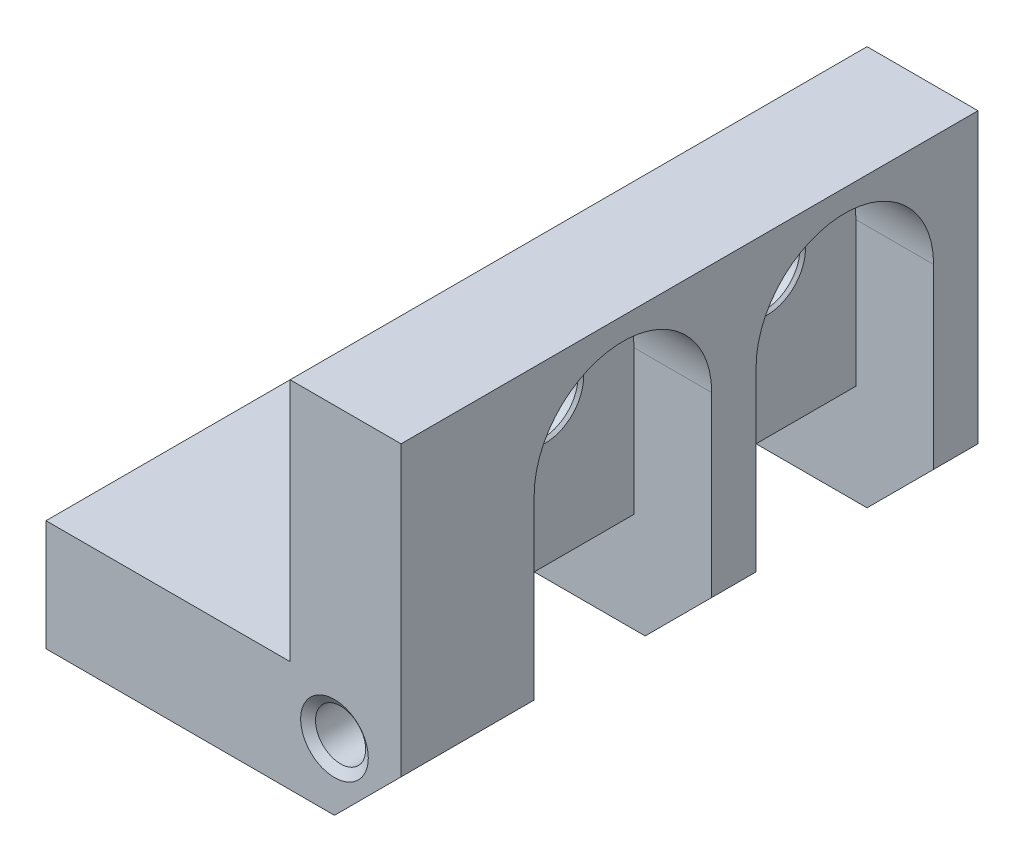
ISO-10303-21;
HEADER;
FILE_DESCRIPTION(('STEP AP214'),'2;1');
FILE_NAME('part.step','',(''),(''),'','','');
FILE_SCHEMA(('AUTOMOTIVE_DESIGN { 1 0 10303 214 1 1 1 1 }'));
ENDSEC;
DATA;
#1=APPLICATION_CONTEXT('core data for automotive mechanical design processes');
#2=APPLICATION_PROTOCOL_DEFINITION('international standard','automotive_design',2000,#1);
#3=PRODUCT_CONTEXT('',#1,'mechanical');
#4=PRODUCT('Part','Part','',(#3));
#5=PRODUCT_RELATED_PRODUCT_CATEGORY('part','',(#4));
#6=PRODUCT_DEFINITION_FORMATION('','',#4);
#7=PRODUCT_DEFINITION_CONTEXT('part definition',#1,'design');
#8=PRODUCT_DEFINITION('design','',#6,#7);
#9=PRODUCT_DEFINITION_SHAPE('','',#8);
#10=(LENGTH_UNIT() NAMED_UNIT(*) SI_UNIT(.MILLI.,.METRE.));
#11=(NAMED_UNIT(*) PLANE_ANGLE_UNIT() SI_UNIT($,.RADIAN.));
#12=(NAMED_UNIT(*) SI_UNIT($,.STERADIAN.) SOLID_ANGLE_UNIT());
#13=UNCERTAINTY_MEASURE_WITH_UNIT(LENGTH_MEASURE(1.E-05),#10,'distance_accuracy_value','');
#14=(GEOMETRIC_REPRESENTATION_CONTEXT(3) GLOBAL_UNCERTAINTY_ASSIGNED_CONTEXT((#13)) GLOBAL_UNIT_ASSIGNED_CONTEXT((#10,
#11,#12)) REPRESENTATION_CONTEXT('',''));
#15=CARTESIAN_POINT('',(0.,0.,0.));
#16=DIRECTION('',(0.,0.,1.));
#17=DIRECTION('',(1.,0.,0.));
#18=AXIS2_PLACEMENT_3D('',#15,#16,#17);
#19=CARTESIAN_POINT('',(4.5,0.,26.));
#20=DIRECTION('',(1.,0.,0.));
#21=DIRECTION('',(0.,1.,0.));
#22=AXIS2_PLACEMENT_3D('',#19,#20,#21);
#23=PLANE('',#22);
#24=CARTESIAN_POINT('',(4.5,3.,6.00000000000002));
#25=DIRECTION('',(1.,0.,0.));
#26=DIRECTION('',(0.,0.,-1.));
#27=AXIS2_PLACEMENT_3D('',#24,#25,#26);
#28=CIRCLE('',#27,1.725);
#29=CARTESIAN_POINT('',(4.5,3.,4.27500000000002));
#30=VERTEX_POINT('',#29);
#31=EDGE_CURVE('E450',#30,#30,#28,.T.);
#32=ORIENTED_EDGE('',*,*,#31,.F.);
#33=EDGE_LOOP('',(#32));
#34=FACE_BOUND('',#33,.T.);
#35=DIRECTION('',(0.,-1.,0.));
#36=VECTOR('',#35,1.);
#37=CARTESIAN_POINT('',(4.5,0.,10.));
#38=LINE('',#37,#36);
#39=CARTESIAN_POINT('',(4.5,3.,10.));
#40=VERTEX_POINT('',#39);
#41=CARTESIAN_POINT('',(4.5,-3.5,10.));
#42=VERTEX_POINT('',#41);
#43=EDGE_CURVE('E247',#40,#42,#38,.T.);
#44=ORIENTED_EDGE('',*,*,#43,.T.);
#45=DIRECTION('',(0.,0.,-1.));
#46=VECTOR('',#45,1.);
#47=CARTESIAN_POINT('',(4.5,-3.5,26.));
#48=LINE('',#47,#46);
#49=CARTESIAN_POINT('',(4.5,-3.5,2.00000000000002));
#50=VERTEX_POINT('',#49);
#51=EDGE_CURVE('E332',#42,#50,#48,.T.);
#52=ORIENTED_EDGE('',*,*,#51,.T.);
#53=DIRECTION('',(0.,-1.,0.));
#54=VECTOR('',#53,1.);
#55=CARTESIAN_POINT('',(4.5,0.,2.00000000000002));
#56=LINE('',#55,#54);
#57=CARTESIAN_POINT('',(4.5,3.,2.00000000000002));
#58=VERTEX_POINT('',#57);
#59=EDGE_CURVE('E243',#58,#50,#56,.T.);
#60=ORIENTED_EDGE('',*,*,#59,.F.);
#61=CARTESIAN_POINT('',(4.5,3.,6.00000000000002));
#62=DIRECTION('',(1.,0.,0.));
#63=DIRECTION('',(0.,1.,0.));
#64=AXIS2_PLACEMENT_3D('',#61,#62,#63);
#65=CIRCLE('',#64,4.);
#66=EDGE_CURVE('E246',#58,#40,#65,.T.);
#67=ORIENTED_EDGE('',*,*,#66,.T.);
#68=EDGE_LOOP('',(#44,#52,#60,#67));
#69=FACE_BOUND('',#68,.T.);
#70=ADVANCED_FACE('F33',(#34,#69),#23,.T.);
#71=CARTESIAN_POINT('',(4.5,0.,26.));
#72=DIRECTION('',(1.,0.,0.));
#73=DIRECTION('',(0.,1.,0.));
#74=AXIS2_PLACEMENT_3D('',#71,#72,#73);
#75=PLANE('',#74);
#76=CARTESIAN_POINT('',(4.5,3.,16.));
#77=DIRECTION('',(1.,0.,0.));
#78=DIRECTION('',(0.,0.,-1.));
#79=AXIS2_PLACEMENT_3D('',#76,#77,#78);
#80=CIRCLE('',#79,1.725);
#81=CARTESIAN_POINT('',(4.5,3.,14.275));
#82=VERTEX_POINT('',#81);
#83=EDGE_CURVE('E438',#82,#82,#80,.T.);
#84=ORIENTED_EDGE('',*,*,#83,.F.);
#85=EDGE_LOOP('',(#84));
#86=FACE_BOUND('',#85,.T.);
#87=DIRECTION('',(0.,-1.,0.));
#88=VECTOR('',#87,1.);
#89=CARTESIAN_POINT('',(4.5,0.,20.));
#90=LINE('',#89,#88);
#91=CARTESIAN_POINT('',(4.5,3.,20.));
#92=VERTEX_POINT('',#91);
#93=CARTESIAN_POINT('',(4.5,-3.5,20.));
#94=VERTEX_POINT('',#93);
#95=EDGE_CURVE('E265',#92,#94,#90,.T.);
#96=ORIENTED_EDGE('',*,*,#95,.T.);
#97=DIRECTION('',(0.,0.,-1.));
#98=VECTOR('',#97,1.);
#99=CARTESIAN_POINT('',(4.5,-3.5,26.));
#100=LINE('',#99,#98);
#101=CARTESIAN_POINT('',(4.5,-3.5,12.));
#102=VERTEX_POINT('',#101);
#103=EDGE_CURVE('E337',#94,#102,#100,.T.);
#104=ORIENTED_EDGE('',*,*,#103,.T.);
#105=DIRECTION('',(0.,-1.,0.));
#106=VECTOR('',#105,1.);
#107=CARTESIAN_POINT('',(4.5,0.,12.));
#108=LINE('',#107,#106);
#109=CARTESIAN_POINT('',(4.5,3.,12.));
#110=VERTEX_POINT('',#109);
#111=EDGE_CURVE('E268',#110,#102,#108,.T.);
#112=ORIENTED_EDGE('',*,*,#111,.F.);
#113=CARTESIAN_POINT('',(4.5,3.,16.));
#114=DIRECTION('',(1.,0.,0.));
#115=DIRECTION('',(0.,1.,0.));
#116=AXIS2_PLACEMENT_3D('',#113,#114,#115);
#117=CIRCLE('',#116,4.);
#118=EDGE_CURVE('E272',#92,#110,#117,.F.);
#119=ORIENTED_EDGE('',*,*,#118,.F.);
#120=EDGE_LOOP('',(#96,#104,#112,#119));
#121=FACE_BOUND('',#120,.T.);
#122=ADVANCED_FACE('F519',(#86,#121),#75,.T.);
#123=CARTESIAN_POINT('',(8.,-8.,26.));
#124=DIRECTION('',(-1.,0.,0.));
#125=DIRECTION('',(0.,0.,1.));
#126=AXIS2_PLACEMENT_3D('',#123,#124,#125);
#127=PLANE('',#126);
#128=DIRECTION('',(0.,1.,0.));
#129=VECTOR('',#128,1.);
#130=CARTESIAN_POINT('',(8.,0.,2.00000000000002));
#131=LINE('',#130,#129);
#132=CARTESIAN_POINT('',(8.,-5.,2.00000000000002));
#133=VERTEX_POINT('',#132);
#134=CARTESIAN_POINT('',(8.,3.,2.00000000000002));
#135=VERTEX_POINT('',#134);
#136=EDGE_CURVE('E255',#133,#135,#131,.T.);
#137=ORIENTED_EDGE('',*,*,#136,.F.);
#138=DIRECTION('',(0.,0.,-1.));
#139=VECTOR('',#138,1.);
#140=CARTESIAN_POINT('',(8.,-5.,26.));
#141=LINE('',#140,#139);
#142=CARTESIAN_POINT('',(8.,-5.00000000000001,0.));
#143=VERTEX_POINT('',#142);
#144=EDGE_CURVE('E356',#133,#143,#141,.T.);
#145=ORIENTED_EDGE('',*,*,#144,.T.);
#146=DIRECTION('',(0.,1.,0.));
#147=VECTOR('',#146,1.);
#148=CARTESIAN_POINT('',(8.,-8.,0.));
#149=LINE('',#148,#147);
#150=CARTESIAN_POINT('',(8.,8.,0.));
#151=VERTEX_POINT('',#150);
#152=EDGE_CURVE('E303',#143,#151,#149,.T.);
#153=ORIENTED_EDGE('',*,*,#152,.T.);
#154=DIRECTION('',(0.,0.,-1.));
#155=VECTOR('',#154,1.);
#156=CARTESIAN_POINT('',(8.,8.,26.));
#157=LINE('',#156,#155);
#158=CARTESIAN_POINT('',(8.,8.,26.));
#159=VERTEX_POINT('',#158);
#160=EDGE_CURVE('E329',#159,#151,#157,.T.);
#161=ORIENTED_EDGE('',*,*,#160,.F.);
#162=DIRECTION('',(0.,1.,0.));
#163=VECTOR('',#162,1.);
#164=CARTESIAN_POINT('',(8.,-8.,26.));
#165=LINE('',#164,#163);
#166=CARTESIAN_POINT('',(8.,-5.,26.));
#167=VERTEX_POINT('',#166);
#168=EDGE_CURVE('E309',#167,#159,#165,.T.);
#169=ORIENTED_EDGE('',*,*,#168,.F.);
#170=DIRECTION('',(0.,0.,-1.));
#171=VECTOR('',#170,1.);
#172=CARTESIAN_POINT('',(8.,-5.,26.));
#173=LINE('',#172,#171);
#174=CARTESIAN_POINT('',(8.,-5.,20.));
#175=VERTEX_POINT('',#174);
#176=EDGE_CURVE('E350',#167,#175,#173,.T.);
#177=ORIENTED_EDGE('',*,*,#176,.T.);
#178=DIRECTION('',(0.,1.,0.));
#179=VECTOR('',#178,1.);
#180=CARTESIAN_POINT('',(8.,0.,20.));
#181=LINE('',#180,#179);
#182=CARTESIAN_POINT('',(8.,3.,20.));
#183=VERTEX_POINT('',#182);
#184=EDGE_CURVE('E277',#175,#183,#181,.T.);
#185=ORIENTED_EDGE('',*,*,#184,.T.);
#186=CARTESIAN_POINT('',(8.,3.,16.));
#187=DIRECTION('',(1.,0.,0.));
#188=DIRECTION('',(0.,0.,-1.));
#189=AXIS2_PLACEMENT_3D('',#186,#187,#188);
#190=CIRCLE('',#189,4.);
#191=CARTESIAN_POINT('',(8.,3.,12.));
#192=VERTEX_POINT('',#191);
#193=EDGE_CURVE('E274',#192,#183,#190,.T.);
#194=ORIENTED_EDGE('',*,*,#193,.F.);
#195=DIRECTION('',(0.,1.,0.));
#196=VECTOR('',#195,1.);
#197=CARTESIAN_POINT('',(8.,0.,12.));
#198=LINE('',#197,#196);
#199=CARTESIAN_POINT('',(8.,-5.,12.));
#200=VERTEX_POINT('',#199);
#201=EDGE_CURVE('E250',#200,#192,#198,.T.);
#202=ORIENTED_EDGE('',*,*,#201,.F.);
#203=DIRECTION('',(0.,0.,-1.));
#204=VECTOR('',#203,1.);
#205=CARTESIAN_POINT('',(8.,-5.,26.));
#206=LINE('',#205,#204);
#207=CARTESIAN_POINT('',(8.,-5.,10.));
#208=VERTEX_POINT('',#207);
#209=EDGE_CURVE('E353',#200,#208,#206,.T.);
#210=ORIENTED_EDGE('',*,*,#209,.T.);
#211=DIRECTION('',(0.,1.,0.));
#212=VECTOR('',#211,1.);
#213=CARTESIAN_POINT('',(8.,0.,10.));
#214=LINE('',#213,#212);
#215=CARTESIAN_POINT('',(8.,3.,10.));
#216=VERTEX_POINT('',#215);
#217=EDGE_CURVE('E253',#208,#216,#214,.T.);
#218=ORIENTED_EDGE('',*,*,#217,.T.);
#219=CARTESIAN_POINT('',(8.,3.,6.00000000000002));
#220=DIRECTION('',(1.,0.,0.));
#221=DIRECTION('',(0.,0.,-1.));
#222=AXIS2_PLACEMENT_3D('',#219,#220,#221);
#223=CIRCLE('',#222,4.);
#224=EDGE_CURVE('E242',#216,#135,#223,.F.);
#225=ORIENTED_EDGE('',*,*,#224,.T.);
#226=EDGE_LOOP('',(#137,#145,#153,#161,#169,#177,#185,#194,#202,#210,#218,#225));
#227=FACE_BOUND('',#226,.T.);
#228=ADVANCED_FACE('F384',(#227),#127,.F.);
#229=CARTESIAN_POINT('',(-8.,-8.,26.));
#230=DIRECTION('',(0.,1.,0.));
#231=DIRECTION('',(0.,0.,1.));
#232=AXIS2_PLACEMENT_3D('',#229,#230,#231);
#233=PLANE('',#232);
#234=DIRECTION('',(1.,0.,0.));
#235=VECTOR('',#234,1.);
#236=CARTESIAN_POINT('',(-8.,-8.,0.));
#237=LINE('',#236,#235);
#238=CARTESIAN_POINT('',(-8.,-8.,0.));
#239=VERTEX_POINT('',#238);
#240=CARTESIAN_POINT('',(4.99999999999999,-8.,0.));
#241=VERTEX_POINT('',#240);
#242=EDGE_CURVE('E312',#239,#241,#237,.T.);
#243=ORIENTED_EDGE('',*,*,#242,.T.);
#244=DIRECTION('',(0.,0.,1.));
#245=VECTOR('',#244,1.);
#246=CARTESIAN_POINT('',(4.99999999999999,-8.,26.));
#247=LINE('',#246,#245);
#248=CARTESIAN_POINT('',(4.99999999999999,-8.00000000000001,2.00000000000002));
#249=VERTEX_POINT('',#248);
#250=EDGE_CURVE('E48',#241,#249,#247,.T.);
#251=ORIENTED_EDGE('',*,*,#250,.T.);
#252=DIRECTION('',(1.,0.,0.));
#253=VECTOR('',#252,1.);
#254=CARTESIAN_POINT('',(-14.,-8.,2.00000000000002));
#255=LINE('',#254,#253);
#256=CARTESIAN_POINT('',(-3.,-8.,2.00000000000002));
#257=VERTEX_POINT('',#256);
#258=EDGE_CURVE('E198',#257,#249,#255,.T.);
#259=ORIENTED_EDGE('',*,*,#258,.F.);
#260=CARTESIAN_POINT('',(-3.,-8.,6.00000000000002));
#261=DIRECTION('',(0.,-1.,0.));
#262=DIRECTION('',(0.,0.,-1.));
#263=AXIS2_PLACEMENT_3D('',#260,#261,#262);
#264=CIRCLE('',#263,4.);
#265=CARTESIAN_POINT('',(-3.,-8.,10.));
#266=VERTEX_POINT('',#265);
#267=EDGE_CURVE('E205',#266,#257,#264,.T.);
#268=ORIENTED_EDGE('',*,*,#267,.F.);
#269=DIRECTION('',(1.,0.,0.));
#270=VECTOR('',#269,1.);
#271=CARTESIAN_POINT('',(-14.,-8.,10.));
#272=LINE('',#271,#270);
#273=CARTESIAN_POINT('',(4.99999999999999,-8.,10.));
#274=VERTEX_POINT('',#273);
#275=EDGE_CURVE('E189',#266,#274,#272,.T.);
#276=ORIENTED_EDGE('',*,*,#275,.T.);
#277=DIRECTION('',(0.,0.,1.));
#278=VECTOR('',#277,1.);
#279=CARTESIAN_POINT('',(4.99999999999999,-8.,26.));
#280=LINE('',#279,#278);
#281=CARTESIAN_POINT('',(4.99999999999999,-8.00000000000001,12.));
#282=VERTEX_POINT('',#281);
#283=EDGE_CURVE('E362',#274,#282,#280,.T.);
#284=ORIENTED_EDGE('',*,*,#283,.T.);
#285=DIRECTION('',(1.,0.,0.));
#286=VECTOR('',#285,1.);
#287=CARTESIAN_POINT('',(-14.,-8.,12.));
#288=LINE('',#287,#286);
#289=CARTESIAN_POINT('',(-3.,-8.,12.));
#290=VERTEX_POINT('',#289);
#291=EDGE_CURVE('E269',#290,#282,#288,.T.);
#292=ORIENTED_EDGE('',*,*,#291,.F.);
#293=CARTESIAN_POINT('',(-3.,-8.,16.));
#294=DIRECTION('',(0.,-1.,0.));
#295=DIRECTION('',(0.,0.,-1.));
#296=AXIS2_PLACEMENT_3D('',#293,#294,#295);
#297=CIRCLE('',#296,4.);
#298=CARTESIAN_POINT('',(-3.,-8.,20.));
#299=VERTEX_POINT('',#298);
#300=EDGE_CURVE('E225',#299,#290,#297,.T.);
#301=ORIENTED_EDGE('',*,*,#300,.F.);
#302=DIRECTION('',(1.,0.,0.));
#303=VECTOR('',#302,1.);
#304=CARTESIAN_POINT('',(-14.,-8.,20.));
#305=LINE('',#304,#303);
#306=CARTESIAN_POINT('',(4.99999999999999,-8.,20.));
#307=VERTEX_POINT('',#306);
#308=EDGE_CURVE('E282',#299,#307,#305,.T.);
#309=ORIENTED_EDGE('',*,*,#308,.T.);
#310=DIRECTION('',(0.,0.,1.));
#311=VECTOR('',#310,1.);
#312=CARTESIAN_POINT('',(4.99999999999999,-8.,26.));
#313=LINE('',#312,#311);
#314=CARTESIAN_POINT('',(4.99999999999999,-8.,26.));
#315=VERTEX_POINT('',#314);
#316=EDGE_CURVE('E55',#307,#315,#313,.T.);
#317=ORIENTED_EDGE('',*,*,#316,.T.);
#318=DIRECTION('',(1.,0.,0.));
#319=VECTOR('',#318,1.);
#320=CARTESIAN_POINT('',(-8.,-8.,26.));
#321=LINE('',#320,#319);
#322=CARTESIAN_POINT('',(-8.,-8.,26.));
#323=VERTEX_POINT('',#322);
#324=EDGE_CURVE('E317',#323,#315,#321,.T.);
#325=ORIENTED_EDGE('',*,*,#324,.F.);
#326=DIRECTION('',(0.,0.,-1.));
#327=VECTOR('',#326,1.);
#328=CARTESIAN_POINT('',(-8.,-8.,26.));
#329=LINE('',#328,#327);
#330=EDGE_CURVE('E319',#323,#239,#329,.T.);
#331=ORIENTED_EDGE('',*,*,#330,.T.);
#332=EDGE_LOOP('',(#243,#251,#259,#268,#276,#284,#292,#301,#309,#317,#325,#331));
#333=FACE_BOUND('',#332,.T.);
#334=ADVANCED_FACE('F211',(#333),#233,.F.);
#335=CARTESIAN_POINT('',(-8.,8.,26.));
#336=DIRECTION('',(0.,-1.,0.));
#337=DIRECTION('',(0.,0.,-1.));
#338=AXIS2_PLACEMENT_3D('',#335,#336,#337);
#339=PLANE('',#338);
#340=DIRECTION('',(-1.,0.,0.));
#341=VECTOR('',#340,1.);
#342=CARTESIAN_POINT('',(-8.,8.,0.));
#343=LINE('',#342,#341);
#344=CARTESIAN_POINT('',(3.,8.,0.));
#345=VERTEX_POINT('',#344);
#346=EDGE_CURVE('E321',#151,#345,#343,.T.);
#347=ORIENTED_EDGE('',*,*,#346,.T.);
#348=DIRECTION('',(0.,0.,-1.));
#349=VECTOR('',#348,1.);
#350=CARTESIAN_POINT('',(3.,8.,26.));
#351=LINE('',#350,#349);
#352=CARTESIAN_POINT('',(3.,8.,26.));
#353=VERTEX_POINT('',#352);
#354=EDGE_CURVE('E301',#353,#345,#351,.T.);
#355=ORIENTED_EDGE('',*,*,#354,.F.);
#356=DIRECTION('',(-1.,0.,0.));
#357=VECTOR('',#356,1.);
#358=CARTESIAN_POINT('',(-8.,8.,26.));
#359=LINE('',#358,#357);
#360=EDGE_CURVE('E311',#159,#353,#359,.T.);
#361=ORIENTED_EDGE('',*,*,#360,.F.);
#362=ORIENTED_EDGE('',*,*,#160,.T.);
#363=EDGE_LOOP('',(#347,#355,#361,#362));
#364=FACE_BOUND('',#363,.T.);
#365=ADVANCED_FACE('F388',(#364),#339,.F.);
#366=CARTESIAN_POINT('',(-8.,-8.,26.));
#367=DIRECTION('',(1.,0.,0.));
#368=DIRECTION('',(0.,0.,-1.));
#369=AXIS2_PLACEMENT_3D('',#366,#367,#368);
#370=PLANE('',#369);
#371=DIRECTION('',(0.,-1.,0.));
#372=VECTOR('',#371,1.);
#373=CARTESIAN_POINT('',(-8.,-8.,26.));
#374=LINE('',#373,#372);
#375=CARTESIAN_POINT('',(-8.,-3.,26.));
#376=VERTEX_POINT('',#375);
#377=EDGE_CURVE('E315',#376,#323,#374,.T.);
#378=ORIENTED_EDGE('',*,*,#377,.F.);
#379=DIRECTION('',(0.,0.,-1.));
#380=VECTOR('',#379,1.);
#381=CARTESIAN_POINT('',(-8.,-3.,26.));
#382=LINE('',#381,#380);
#383=CARTESIAN_POINT('',(-8.,-3.,0.));
#384=VERTEX_POINT('',#383);
#385=EDGE_CURVE('E304',#376,#384,#382,.T.);
#386=ORIENTED_EDGE('',*,*,#385,.T.);
#387=DIRECTION('',(0.,-1.,0.));
#388=VECTOR('',#387,1.);
#389=CARTESIAN_POINT('',(-8.,-8.,0.));
#390=LINE('',#389,#388);
#391=EDGE_CURVE('E324',#384,#239,#390,.T.);
#392=ORIENTED_EDGE('',*,*,#391,.T.);
#393=ORIENTED_EDGE('',*,*,#330,.F.);
#394=EDGE_LOOP('',(#378,#386,#392,#393));
#395=FACE_BOUND('',#394,.T.);
#396=ADVANCED_FACE('F400',(#395),#370,.F.);
#397=CARTESIAN_POINT('',(8.,8.,26.));
#398=DIRECTION('',(0.,0.,-1.));
#399=DIRECTION('',(-1.,0.,0.));
#400=AXIS2_PLACEMENT_3D('',#397,#398,#399);
#401=PLANE('',#400);
#402=CARTESIAN_POINT('',(5.,-5.,26.));
#403=DIRECTION('',(0.,0.,1.));
#404=DIRECTION('',(1.,0.,0.));
#405=AXIS2_PLACEMENT_3D('',#402,#403,#404);
#406=CIRCLE('',#405,1.524);
#407=CARTESIAN_POINT('',(6.524,-5.,26.));
#408=VERTEX_POINT('',#407);
#409=EDGE_CURVE('E216',#408,#408,#406,.T.);
#410=ORIENTED_EDGE('',*,*,#409,.F.);
#411=EDGE_LOOP('',(#410));
#412=FACE_BOUND('',#411,.T.);
#413=ORIENTED_EDGE('',*,*,#324,.T.);
#414=DIRECTION('',(-0.707106781186549,-0.707106781186546,0.));
#415=VECTOR('',#414,1.);
#416=CARTESIAN_POINT('',(8.,-5.,26.));
#417=LINE('',#416,#415);
#418=EDGE_CURVE('E12',#315,#167,#417,.F.);
#419=ORIENTED_EDGE('',*,*,#418,.T.);
#420=ORIENTED_EDGE('',*,*,#168,.T.);
#421=ORIENTED_EDGE('',*,*,#360,.T.);
#422=DIRECTION('',(0.,-1.,0.));
#423=VECTOR('',#422,1.);
#424=CARTESIAN_POINT('',(3.,0.,26.));
#425=LINE('',#424,#423);
#426=CARTESIAN_POINT('',(3.,-3.,26.));
#427=VERTEX_POINT('',#426);
#428=EDGE_CURVE('E291',#353,#427,#425,.T.);
#429=ORIENTED_EDGE('',*,*,#428,.T.);
#430=DIRECTION('',(-1.,0.,0.));
#431=VECTOR('',#430,1.);
#432=CARTESIAN_POINT('',(-17.7414213562373,-3.,26.));
#433=LINE('',#432,#431);
#434=EDGE_CURVE('E294',#427,#376,#433,.T.);
#435=ORIENTED_EDGE('',*,*,#434,.T.);
#436=ORIENTED_EDGE('',*,*,#377,.T.);
#437=EDGE_LOOP('',(#413,#419,#420,#421,#429,#435,#436));
#438=FACE_BOUND('',#437,.T.);
#439=ADVANCED_FACE('F379',(#412,#438),#401,.F.);
#440=CARTESIAN_POINT('',(8.,8.,0.));
#441=DIRECTION('',(0.,0.,-1.));
#442=DIRECTION('',(-1.,0.,0.));
#443=AXIS2_PLACEMENT_3D('',#440,#441,#442);
#444=PLANE('',#443);
#445=ORIENTED_EDGE('',*,*,#152,.F.);
#446=DIRECTION('',(0.707106781186549,0.707106781186546,0.));
#447=VECTOR('',#446,1.);
#448=CARTESIAN_POINT('',(14.5,1.49999999999997,0.));
#449=LINE('',#448,#447);
#450=EDGE_CURVE('E359',#143,#241,#449,.F.);
#451=ORIENTED_EDGE('',*,*,#450,.T.);
#452=ORIENTED_EDGE('',*,*,#242,.F.);
#453=ORIENTED_EDGE('',*,*,#391,.F.);
#454=DIRECTION('',(-1.,0.,0.));
#455=VECTOR('',#454,1.);
#456=CARTESIAN_POINT('',(-17.7414213562373,-3.,0.));
#457=LINE('',#456,#455);
#458=CARTESIAN_POINT('',(3.,-3.,0.));
#459=VERTEX_POINT('',#458);
#460=EDGE_CURVE('E295',#459,#384,#457,.T.);
#461=ORIENTED_EDGE('',*,*,#460,.F.);
#462=DIRECTION('',(0.,-1.,0.));
#463=VECTOR('',#462,1.);
#464=CARTESIAN_POINT('',(3.,0.,0.));
#465=LINE('',#464,#463);
#466=EDGE_CURVE('E290',#345,#459,#465,.T.);
#467=ORIENTED_EDGE('',*,*,#466,.F.);
#468=ORIENTED_EDGE('',*,*,#346,.F.);
#469=EDGE_LOOP('',(#445,#451,#452,#453,#461,#467,#468));
#470=FACE_BOUND('',#469,.T.);
#471=ADVANCED_FACE('F404',(#470),#444,.T.);
#472=CARTESIAN_POINT('',(3.,0.,26.));
#473=DIRECTION('',(1.,0.,0.));
#474=DIRECTION('',(0.,1.,0.));
#475=AXIS2_PLACEMENT_3D('',#472,#473,#474);
#476=PLANE('',#475);
#477=CARTESIAN_POINT('',(3.,3.,6.00000000000002));
#478=DIRECTION('',(1.,0.,0.));
#479=DIRECTION('',(0.,0.,-1.));
#480=AXIS2_PLACEMENT_3D('',#477,#478,#479);
#481=CIRCLE('',#480,1.725);
#482=CARTESIAN_POINT('',(3.,3.,4.27500000000002));
#483=VERTEX_POINT('',#482);
#484=EDGE_CURVE('E453',#483,#483,#481,.T.);
#485=ORIENTED_EDGE('',*,*,#484,.T.);
#486=EDGE_LOOP('',(#485));
#487=FACE_BOUND('',#486,.T.);
#488=CARTESIAN_POINT('',(3.,3.,16.));
#489=DIRECTION('',(1.,0.,0.));
#490=DIRECTION('',(0.,0.,-1.));
#491=AXIS2_PLACEMENT_3D('',#488,#489,#490);
#492=CIRCLE('',#491,1.725);
#493=CARTESIAN_POINT('',(3.,3.,14.275));
#494=VERTEX_POINT('',#493);
#495=EDGE_CURVE('E441',#494,#494,#492,.T.);
#496=ORIENTED_EDGE('',*,*,#495,.T.);
#497=EDGE_LOOP('',(#496));
#498=FACE_BOUND('',#497,.T.);
#499=ORIENTED_EDGE('',*,*,#466,.T.);
#500=DIRECTION('',(0.,0.,-1.));
#501=VECTOR('',#500,1.);
#502=CARTESIAN_POINT('',(3.,-3.,26.));
#503=LINE('',#502,#501);
#504=EDGE_CURVE('E298',#427,#459,#503,.T.);
#505=ORIENTED_EDGE('',*,*,#504,.F.);
#506=ORIENTED_EDGE('',*,*,#428,.F.);
#507=ORIENTED_EDGE('',*,*,#354,.T.);
#508=EDGE_LOOP('',(#499,#505,#506,#507));
#509=FACE_BOUND('',#508,.T.);
#510=ADVANCED_FACE('F393',(#487,#498,#509),#476,.F.);
#511=CARTESIAN_POINT('',(-17.7414213562373,-3.,26.));
#512=DIRECTION('',(0.,-1.,0.));
#513=DIRECTION('',(1.,0.,0.));
#514=AXIS2_PLACEMENT_3D('',#511,#512,#513);
#515=PLANE('',#514);
#516=CARTESIAN_POINT('',(-3.,-3.,16.));
#517=DIRECTION('',(0.,-1.,0.));
#518=DIRECTION('',(0.,0.,-1.));
#519=AXIS2_PLACEMENT_3D('',#516,#517,#518);
#520=CIRCLE('',#519,1.725);
#521=CARTESIAN_POINT('',(-3.,-3.,14.275));
#522=VERTEX_POINT('',#521);
#523=EDGE_CURVE('E477',#522,#522,#520,.T.);
#524=ORIENTED_EDGE('',*,*,#523,.T.);
#525=EDGE_LOOP('',(#524));
#526=FACE_BOUND('',#525,.T.);
#527=CARTESIAN_POINT('',(-3.,-3.,6.00000000000002));
#528=DIRECTION('',(0.,-1.,0.));
#529=DIRECTION('',(0.,0.,-1.));
#530=AXIS2_PLACEMENT_3D('',#527,#528,#529);
#531=CIRCLE('',#530,1.725);
#532=CARTESIAN_POINT('',(-3.,-3.,4.27500000000002));
#533=VERTEX_POINT('',#532);
#534=EDGE_CURVE('E465',#533,#533,#531,.T.);
#535=ORIENTED_EDGE('',*,*,#534,.T.);
#536=EDGE_LOOP('',(#535));
#537=FACE_BOUND('',#536,.T.);
#538=ORIENTED_EDGE('',*,*,#460,.T.);
#539=ORIENTED_EDGE('',*,*,#385,.F.);
#540=ORIENTED_EDGE('',*,*,#434,.F.);
#541=ORIENTED_EDGE('',*,*,#504,.T.);
#542=EDGE_LOOP('',(#538,#539,#540,#541));
#543=FACE_BOUND('',#542,.T.);
#544=ADVANCED_FACE('F397',(#526,#537,#543),#515,.F.);
#545=CARTESIAN_POINT('',(-14.,0.,12.));
#546=DIRECTION('',(0.,0.,-1.));
#547=DIRECTION('',(-1.,0.,0.));
#548=AXIS2_PLACEMENT_3D('',#545,#546,#547);
#549=PLANE('',#548);
#550=ORIENTED_EDGE('',*,*,#291,.T.);
#551=DIRECTION('',(-0.707106781186549,-0.707106781186546,0.));
#552=VECTOR('',#551,1.);
#553=CARTESIAN_POINT('',(8.,-5.,12.));
#554=LINE('',#553,#552);
#555=EDGE_CURVE('E368',#282,#200,#554,.F.);
#556=ORIENTED_EDGE('',*,*,#555,.T.);
#557=ORIENTED_EDGE('',*,*,#201,.T.);
#558=DIRECTION('',(1.,0.,0.));
#559=VECTOR('',#558,1.);
#560=CARTESIAN_POINT('',(-14.,3.,12.));
#561=LINE('',#560,#559);
#562=EDGE_CURVE('E279',#110,#192,#561,.T.);
#563=ORIENTED_EDGE('',*,*,#562,.F.);
#564=ORIENTED_EDGE('',*,*,#111,.T.);
#565=DIRECTION('',(0.707106781186549,0.707106781186546,0.));
#566=VECTOR('',#565,1.);
#567=CARTESIAN_POINT('',(-3.00000000000004,-11.,12.));
#568=LINE('',#567,#566);
#569=CARTESIAN_POINT('',(3.49999999999999,-4.5,12.));
#570=VERTEX_POINT('',#569);
#571=EDGE_CURVE('E346',#102,#570,#568,.F.);
#572=ORIENTED_EDGE('',*,*,#571,.T.);
#573=DIRECTION('',(1.,0.,0.));
#574=VECTOR('',#573,1.);
#575=CARTESIAN_POINT('',(0.,-4.5,12.));
#576=LINE('',#575,#574);
#577=CARTESIAN_POINT('',(-3.,-4.5,12.));
#578=VERTEX_POINT('',#577);
#579=EDGE_CURVE('E226',#578,#570,#576,.T.);
#580=ORIENTED_EDGE('',*,*,#579,.F.);
#581=DIRECTION('',(0.,-1.,0.));
#582=VECTOR('',#581,1.);
#583=CARTESIAN_POINT('',(-3.,11.0089257261219,12.));
#584=LINE('',#583,#582);
#585=EDGE_CURVE('E230',#578,#290,#584,.T.);
#586=ORIENTED_EDGE('',*,*,#585,.T.);
#587=EDGE_LOOP('',(#550,#556,#557,#563,#564,#572,#580,#586));
#588=FACE_BOUND('',#587,.T.);
#589=ADVANCED_FACE('F530',(#588),#549,.F.);
#590=CARTESIAN_POINT('',(-14.,0.,20.));
#591=DIRECTION('',(0.,0.,-1.));
#592=DIRECTION('',(-1.,0.,0.));
#593=AXIS2_PLACEMENT_3D('',#590,#591,#592);
#594=PLANE('',#593);
#595=CARTESIAN_POINT('',(5.,-5.,20.));
#596=DIRECTION('',(0.,0.,-1.));
#597=DIRECTION('',(-1.,0.,0.));
#598=AXIS2_PLACEMENT_3D('',#595,#596,#597);
#599=CIRCLE('',#598,1.1303);
#600=CARTESIAN_POINT('',(3.8697,-5.,20.));
#601=VERTEX_POINT('',#600);
#602=EDGE_CURVE('E213',#601,#601,#599,.T.);
#603=ORIENTED_EDGE('',*,*,#602,.F.);
#604=EDGE_LOOP('',(#603));
#605=FACE_BOUND('',#604,.T.);
#606=ORIENTED_EDGE('',*,*,#184,.F.);
#607=DIRECTION('',(0.707106781186549,0.707106781186546,0.));
#608=VECTOR('',#607,1.);
#609=CARTESIAN_POINT('',(-0.500000000000037,-13.5,20.));
#610=LINE('',#609,#608);
#611=EDGE_CURVE('E41',#175,#307,#610,.F.);
#612=ORIENTED_EDGE('',*,*,#611,.T.);
#613=ORIENTED_EDGE('',*,*,#308,.F.);
#614=DIRECTION('',(0.,-1.,0.));
#615=VECTOR('',#614,1.);
#616=CARTESIAN_POINT('',(-3.,11.0089257261219,20.));
#617=LINE('',#616,#615);
#618=CARTESIAN_POINT('',(-3.,-4.5,20.));
#619=VERTEX_POINT('',#618);
#620=EDGE_CURVE('E236',#619,#299,#617,.T.);
#621=ORIENTED_EDGE('',*,*,#620,.F.);
#622=DIRECTION('',(1.,0.,0.));
#623=VECTOR('',#622,1.);
#624=CARTESIAN_POINT('',(0.,-4.5,20.));
#625=LINE('',#624,#623);
#626=CARTESIAN_POINT('',(3.49999999999999,-4.5,20.));
#627=VERTEX_POINT('',#626);
#628=EDGE_CURVE('E229',#619,#627,#625,.T.);
#629=ORIENTED_EDGE('',*,*,#628,.T.);
#630=DIRECTION('',(-0.707106781186549,-0.707106781186546,0.));
#631=VECTOR('',#630,1.);
#632=CARTESIAN_POINT('',(4.5,-3.5,20.));
#633=LINE('',#632,#631);
#634=EDGE_CURVE('E348',#627,#94,#633,.F.);
#635=ORIENTED_EDGE('',*,*,#634,.T.);
#636=ORIENTED_EDGE('',*,*,#95,.F.);
#637=DIRECTION('',(1.,0.,0.));
#638=VECTOR('',#637,1.);
#639=CARTESIAN_POINT('',(-14.,3.,20.));
#640=LINE('',#639,#638);
#641=EDGE_CURVE('E284',#92,#183,#640,.T.);
#642=ORIENTED_EDGE('',*,*,#641,.T.);
#643=EDGE_LOOP('',(#606,#612,#613,#621,#629,#635,#636,#642));
#644=FACE_BOUND('',#643,.T.);
#645=ADVANCED_FACE('F371',(#605,#644),#594,.T.);
#646=CARTESIAN_POINT('',(-14.,3.,16.));
#647=DIRECTION('',(1.,0.,0.));
#648=DIRECTION('',(0.,0.,-1.));
#649=AXIS2_PLACEMENT_3D('',#646,#647,#648);
#650=CYLINDRICAL_SURFACE('',#649,4.);
#651=ORIENTED_EDGE('',*,*,#118,.T.);
#652=ORIENTED_EDGE('',*,*,#562,.T.);
#653=ORIENTED_EDGE('',*,*,#193,.T.);
#654=ORIENTED_EDGE('',*,*,#641,.F.);
#655=EDGE_LOOP('',(#651,#652,#653,#654));
#656=FACE_BOUND('',#655,.T.);
#657=ADVANCED_FACE('F523',(#656),#650,.F.);
#658=CARTESIAN_POINT('',(-14.,0.,10.));
#659=DIRECTION('',(0.,0.,-1.));
#660=DIRECTION('',(0.,1.,0.));
#661=AXIS2_PLACEMENT_3D('',#658,#659,#660);
#662=PLANE('',#661);
#663=ORIENTED_EDGE('',*,*,#217,.F.);
#664=DIRECTION('',(0.707106781186549,0.707106781186546,0.));
#665=VECTOR('',#664,1.);
#666=CARTESIAN_POINT('',(-0.500000000000039,-13.5,10.));
#667=LINE('',#666,#665);
#668=EDGE_CURVE('E195',#208,#274,#667,.F.);
#669=ORIENTED_EDGE('',*,*,#668,.T.);
#670=ORIENTED_EDGE('',*,*,#275,.F.);
#671=DIRECTION('',(0.,-1.,0.));
#672=VECTOR('',#671,1.);
#673=CARTESIAN_POINT('',(-3.,11.0089257261219,10.));
#674=LINE('',#673,#672);
#675=CARTESIAN_POINT('',(-3.,-4.5,10.));
#676=VERTEX_POINT('',#675);
#677=EDGE_CURVE('E194',#676,#266,#674,.T.);
#678=ORIENTED_EDGE('',*,*,#677,.F.);
#679=DIRECTION('',(1.,0.,0.));
#680=VECTOR('',#679,1.);
#681=CARTESIAN_POINT('',(0.,-4.5,10.));
#682=LINE('',#681,#680);
#683=CARTESIAN_POINT('',(3.49999999999999,-4.5,10.));
#684=VERTEX_POINT('',#683);
#685=EDGE_CURVE('E220',#676,#684,#682,.T.);
#686=ORIENTED_EDGE('',*,*,#685,.T.);
#687=DIRECTION('',(-0.707106781186549,-0.707106781186546,0.));
#688=VECTOR('',#687,1.);
#689=CARTESIAN_POINT('',(4.5,-3.5,10.));
#690=LINE('',#689,#688);
#691=EDGE_CURVE('E344',#684,#42,#690,.F.);
#692=ORIENTED_EDGE('',*,*,#691,.T.);
#693=ORIENTED_EDGE('',*,*,#43,.F.);
#694=DIRECTION('',(1.,0.,0.));
#695=VECTOR('',#694,1.);
#696=CARTESIAN_POINT('',(-14.,3.,10.));
#697=LINE('',#696,#695);
#698=EDGE_CURVE('E199',#40,#216,#697,.T.);
#699=ORIENTED_EDGE('',*,*,#698,.T.);
#700=EDGE_LOOP('',(#663,#669,#670,#678,#686,#692,#693,#699));
#701=FACE_BOUND('',#700,.T.);
#702=ADVANCED_FACE('F192',(#701),#662,.T.);
#703=CARTESIAN_POINT('',(-14.,0.,2.00000000000002));
#704=DIRECTION('',(0.,0.,-1.));
#705=DIRECTION('',(-1.,0.,0.));
#706=AXIS2_PLACEMENT_3D('',#703,#704,#705);
#707=PLANE('',#706);
#708=ORIENTED_EDGE('',*,*,#258,.T.);
#709=DIRECTION('',(-0.707106781186549,-0.707106781186546,0.));
#710=VECTOR('',#709,1.);
#711=CARTESIAN_POINT('',(8.,-5.,2.00000000000002));
#712=LINE('',#711,#710);
#713=EDGE_CURVE('E365',#249,#133,#712,.F.);
#714=ORIENTED_EDGE('',*,*,#713,.T.);
#715=ORIENTED_EDGE('',*,*,#136,.T.);
#716=DIRECTION('',(1.,0.,0.));
#717=VECTOR('',#716,1.);
#718=CARTESIAN_POINT('',(-14.,3.,2.00000000000002));
#719=LINE('',#718,#717);
#720=EDGE_CURVE('E257',#58,#135,#719,.T.);
#721=ORIENTED_EDGE('',*,*,#720,.F.);
#722=ORIENTED_EDGE('',*,*,#59,.T.);
#723=DIRECTION('',(0.707106781186549,0.707106781186546,0.));
#724=VECTOR('',#723,1.);
#725=CARTESIAN_POINT('',(-3.00000000000004,-11.,2.00000000000002));
#726=LINE('',#725,#724);
#727=CARTESIAN_POINT('',(3.49999999999999,-4.5,2.00000000000002));
#728=VERTEX_POINT('',#727);
#729=EDGE_CURVE('E342',#50,#728,#726,.F.);
#730=ORIENTED_EDGE('',*,*,#729,.T.);
#731=DIRECTION('',(1.,0.,0.));
#732=VECTOR('',#731,1.);
#733=CARTESIAN_POINT('',(0.,-4.5,2.00000000000002));
#734=LINE('',#733,#732);
#735=CARTESIAN_POINT('',(-3.,-4.5,2.00000000000002));
#736=VERTEX_POINT('',#735);
#737=EDGE_CURVE('E222',#736,#728,#734,.T.);
#738=ORIENTED_EDGE('',*,*,#737,.F.);
#739=DIRECTION('',(0.,-1.,0.));
#740=VECTOR('',#739,1.);
#741=CARTESIAN_POINT('',(-3.,11.0089257261219,2.00000000000002));
#742=LINE('',#741,#740);
#743=EDGE_CURVE('E209',#736,#257,#742,.T.);
#744=ORIENTED_EDGE('',*,*,#743,.T.);
#745=EDGE_LOOP('',(#708,#714,#715,#721,#722,#730,#738,#744));
#746=FACE_BOUND('',#745,.T.);
#747=ADVANCED_FACE('F410',(#746),#707,.F.);
#748=CARTESIAN_POINT('',(-14.,3.,6.00000000000002));
#749=DIRECTION('',(1.,0.,0.));
#750=DIRECTION('',(0.,0.,-1.));
#751=AXIS2_PLACEMENT_3D('',#748,#749,#750);
#752=CYLINDRICAL_SURFACE('',#751,4.);
#753=ORIENTED_EDGE('',*,*,#720,.T.);
#754=ORIENTED_EDGE('',*,*,#224,.F.);
#755=ORIENTED_EDGE('',*,*,#698,.F.);
#756=ORIENTED_EDGE('',*,*,#66,.F.);
#757=EDGE_LOOP('',(#753,#754,#755,#756));
#758=FACE_BOUND('',#757,.T.);
#759=ADVANCED_FACE('F415',(#758),#752,.F.);
#760=CARTESIAN_POINT('',(-3.,11.0089257261219,16.));
#761=DIRECTION('',(0.,-1.,0.));
#762=DIRECTION('',(0.,0.,-1.));
#763=AXIS2_PLACEMENT_3D('',#760,#761,#762);
#764=CYLINDRICAL_SURFACE('',#763,4.);
#765=CARTESIAN_POINT('',(-3.,-4.5,16.));
#766=DIRECTION('',(0.,-1.,0.));
#767=DIRECTION('',(1.,0.,0.));
#768=AXIS2_PLACEMENT_3D('',#765,#766,#767);
#769=CIRCLE('',#768,4.);
#770=EDGE_CURVE('E233',#578,#619,#769,.F.);
#771=ORIENTED_EDGE('',*,*,#770,.T.);
#772=ORIENTED_EDGE('',*,*,#620,.T.);
#773=ORIENTED_EDGE('',*,*,#300,.T.);
#774=ORIENTED_EDGE('',*,*,#585,.F.);
#775=EDGE_LOOP('',(#771,#772,#773,#774));
#776=FACE_BOUND('',#775,.T.);
#777=ADVANCED_FACE('F505',(#776),#764,.F.);
#778=CARTESIAN_POINT('',(-17.7414213562373,-4.5,26.));
#779=DIRECTION('',(0.,-1.,0.));
#780=DIRECTION('',(1.,0.,0.));
#781=AXIS2_PLACEMENT_3D('',#778,#779,#780);
#782=PLANE('',#781);
#783=CARTESIAN_POINT('',(-3.,-4.50000000000001,16.));
#784=DIRECTION('',(0.,-1.,0.));
#785=DIRECTION('',(0.,0.,-1.));
#786=AXIS2_PLACEMENT_3D('',#783,#784,#785);
#787=CIRCLE('',#786,1.725);
#788=CARTESIAN_POINT('',(-3.,-4.50000000000001,14.275));
#789=VERTEX_POINT('',#788);
#790=EDGE_CURVE('E474',#789,#789,#787,.T.);
#791=ORIENTED_EDGE('',*,*,#790,.F.);
#792=EDGE_LOOP('',(#791));
#793=FACE_BOUND('',#792,.T.);
#794=ORIENTED_EDGE('',*,*,#579,.T.);
#795=DIRECTION('',(0.,0.,1.));
#796=VECTOR('',#795,1.);
#797=CARTESIAN_POINT('',(3.49999999999999,-4.5,26.));
#798=LINE('',#797,#796);
#799=EDGE_CURVE('E340',#570,#627,#798,.T.);
#800=ORIENTED_EDGE('',*,*,#799,.T.);
#801=ORIENTED_EDGE('',*,*,#628,.F.);
#802=ORIENTED_EDGE('',*,*,#770,.F.);
#803=EDGE_LOOP('',(#794,#800,#801,#802));
#804=FACE_BOUND('',#803,.T.);
#805=ADVANCED_FACE('F502',(#793,#804),#782,.T.);
#806=CARTESIAN_POINT('',(-3.,11.0089257261219,6.00000000000002));
#807=DIRECTION('',(0.,-1.,0.));
#808=DIRECTION('',(0.,0.,-1.));
#809=AXIS2_PLACEMENT_3D('',#806,#807,#808);
#810=CYLINDRICAL_SURFACE('',#809,4.);
#811=CARTESIAN_POINT('',(-3.,-4.5,6.00000000000002));
#812=DIRECTION('',(0.,-1.,0.));
#813=DIRECTION('',(1.,0.,0.));
#814=AXIS2_PLACEMENT_3D('',#811,#812,#813);
#815=CIRCLE('',#814,4.);
#816=EDGE_CURVE('E207',#736,#676,#815,.F.);
#817=ORIENTED_EDGE('',*,*,#816,.T.);
#818=ORIENTED_EDGE('',*,*,#677,.T.);
#819=ORIENTED_EDGE('',*,*,#267,.T.);
#820=ORIENTED_EDGE('',*,*,#743,.F.);
#821=EDGE_LOOP('',(#817,#818,#819,#820));
#822=FACE_BOUND('',#821,.T.);
#823=ADVANCED_FACE('F203',(#822),#810,.F.);
#824=CARTESIAN_POINT('',(-17.7414213562373,-4.5,26.));
#825=DIRECTION('',(0.,-1.,0.));
#826=DIRECTION('',(1.,0.,0.));
#827=AXIS2_PLACEMENT_3D('',#824,#825,#826);
#828=PLANE('',#827);
#829=CARTESIAN_POINT('',(-3.,-4.50000000000001,6.00000000000002));
#830=DIRECTION('',(0.,-1.,0.));
#831=DIRECTION('',(0.,0.,-1.));
#832=AXIS2_PLACEMENT_3D('',#829,#830,#831);
#833=CIRCLE('',#832,1.725);
#834=CARTESIAN_POINT('',(-3.,-4.50000000000001,4.27500000000002));
#835=VERTEX_POINT('',#834);
#836=EDGE_CURVE('E462',#835,#835,#833,.T.);
#837=ORIENTED_EDGE('',*,*,#836,.F.);
#838=EDGE_LOOP('',(#837));
#839=FACE_BOUND('',#838,.T.);
#840=ORIENTED_EDGE('',*,*,#737,.T.);
#841=DIRECTION('',(0.,0.,1.));
#842=VECTOR('',#841,1.);
#843=CARTESIAN_POINT('',(3.49999999999999,-4.5,26.));
#844=LINE('',#843,#842);
#845=EDGE_CURVE('E335',#728,#684,#844,.T.);
#846=ORIENTED_EDGE('',*,*,#845,.T.);
#847=ORIENTED_EDGE('',*,*,#685,.F.);
#848=ORIENTED_EDGE('',*,*,#816,.F.);
#849=EDGE_LOOP('',(#840,#846,#847,#848));
#850=FACE_BOUND('',#849,.T.);
#851=ADVANCED_FACE('F425',(#839,#850),#828,.T.);
#852=CARTESIAN_POINT('',(4.5,-3.5,26.));
#853=DIRECTION('',(-0.707106781186546,0.707106781186549,0.));
#854=DIRECTION('',(-0.707106781186549,-0.707106781186546,0.));
#855=AXIS2_PLACEMENT_3D('',#852,#853,#854);
#856=PLANE('',#855);
#857=ORIENTED_EDGE('',*,*,#691,.F.);
#858=ORIENTED_EDGE('',*,*,#845,.F.);
#859=ORIENTED_EDGE('',*,*,#729,.F.);
#860=ORIENTED_EDGE('',*,*,#51,.F.);
#861=EDGE_LOOP('',(#857,#858,#859,#860));
#862=FACE_BOUND('',#861,.T.);
#863=ADVANCED_FACE('F421',(#862),#856,.F.);
#864=CARTESIAN_POINT('',(4.5,-3.5,26.));
#865=DIRECTION('',(-0.707106781186546,0.707106781186549,0.));
#866=DIRECTION('',(-0.707106781186549,-0.707106781186546,0.));
#867=AXIS2_PLACEMENT_3D('',#864,#865,#866);
#868=PLANE('',#867);
#869=ORIENTED_EDGE('',*,*,#634,.F.);
#870=ORIENTED_EDGE('',*,*,#799,.F.);
#871=ORIENTED_EDGE('',*,*,#571,.F.);
#872=ORIENTED_EDGE('',*,*,#103,.F.);
#873=EDGE_LOOP('',(#869,#870,#871,#872));
#874=FACE_BOUND('',#873,.T.);
#875=ADVANCED_FACE('F514',(#874),#868,.F.);
#876=CARTESIAN_POINT('',(5.,-5.,26.));
#877=DIRECTION('',(0.,0.,1.));
#878=DIRECTION('',(1.,0.,0.));
#879=AXIS2_PLACEMENT_3D('',#876,#877,#878);
#880=CYLINDRICAL_SURFACE('',#879,1.1303);
#881=CARTESIAN_POINT('',(5.,-5.,25.7243282922069));
#882=DIRECTION('',(0.,0.,1.));
#883=DIRECTION('',(1.,0.,0.));
#884=AXIS2_PLACEMENT_3D('',#881,#882,#883);
#885=CIRCLE('',#884,1.1303);
#886=CARTESIAN_POINT('',(6.1303,-5.,25.7243282922069));
#887=VERTEX_POINT('',#886);
#888=EDGE_CURVE('E429',#887,#887,#885,.T.);
#889=ORIENTED_EDGE('',*,*,#888,.T.);
#890=EDGE_LOOP('',(#889));
#891=FACE_BOUND('',#890,.T.);
#892=ORIENTED_EDGE('',*,*,#602,.T.);
#893=EDGE_LOOP('',(#892));
#894=FACE_BOUND('',#893,.T.);
#895=ADVANCED_FACE('F581',(#891,#894),#880,.F.);
#896=CARTESIAN_POINT('',(5.,-5.,26.));
#897=DIRECTION('',(0.,0.,1.));
#898=DIRECTION('',(1.,0.,0.));
#899=AXIS2_PLACEMENT_3D('',#896,#897,#898);
#900=CONICAL_SURFACE('',#899,1.524,0.959931088596882);
#901=ORIENTED_EDGE('',*,*,#888,.F.);
#902=EDGE_LOOP('',(#901));
#903=FACE_BOUND('',#902,.T.);
#904=ORIENTED_EDGE('',*,*,#409,.T.);
#905=EDGE_LOOP('',(#904));
#906=FACE_BOUND('',#905,.T.);
#907=ADVANCED_FACE('F763',(#903,#906),#900,.F.);
#908=CARTESIAN_POINT('',(3.125,3.,16.));
#909=DIRECTION('',(-1.,0.,0.));
#910=DIRECTION('',(0.,0.,1.));
#911=AXIS2_PLACEMENT_3D('',#908,#909,#910);
#912=CONICAL_SURFACE('',#911,1.6,0.785398163397448);
#913=ORIENTED_EDGE('',*,*,#495,.F.);
#914=EDGE_LOOP('',(#913));
#915=FACE_BOUND('',#914,.T.);
#916=CARTESIAN_POINT('',(3.125,3.,16.));
#917=DIRECTION('',(1.,0.,0.));
#918=DIRECTION('',(0.,0.,-1.));
#919=AXIS2_PLACEMENT_3D('',#916,#917,#918);
#920=CIRCLE('',#919,1.6);
#921=CARTESIAN_POINT('',(3.125,3.,14.4));
#922=VERTEX_POINT('',#921);
#923=EDGE_CURVE('E432',#922,#922,#920,.T.);
#924=ORIENTED_EDGE('',*,*,#923,.T.);
#925=EDGE_LOOP('',(#924));
#926=FACE_BOUND('',#925,.T.);
#927=ADVANCED_FACE('F753',(#915,#926),#912,.F.);
#928=CARTESIAN_POINT('',(4.5,3.,16.));
#929=DIRECTION('',(1.,0.,0.));
#930=DIRECTION('',(0.,0.,-1.));
#931=AXIS2_PLACEMENT_3D('',#928,#929,#930);
#932=CYLINDRICAL_SURFACE('',#931,1.6);
#933=ORIENTED_EDGE('',*,*,#923,.F.);
#934=EDGE_LOOP('',(#933));
#935=FACE_BOUND('',#934,.T.);
#936=CARTESIAN_POINT('',(4.375,3.,16.));
#937=DIRECTION('',(1.,0.,0.));
#938=DIRECTION('',(0.,0.,-1.));
#939=AXIS2_PLACEMENT_3D('',#936,#937,#938);
#940=CIRCLE('',#939,1.6);
#941=CARTESIAN_POINT('',(4.375,3.,14.4));
#942=VERTEX_POINT('',#941);
#943=EDGE_CURVE('E435',#942,#942,#940,.T.);
#944=ORIENTED_EDGE('',*,*,#943,.T.);
#945=EDGE_LOOP('',(#944));
#946=FACE_BOUND('',#945,.T.);
#947=ADVANCED_FACE('F743',(#935,#946),#932,.F.);
#948=CARTESIAN_POINT('',(4.5,3.,16.));
#949=DIRECTION('',(1.,0.,0.));
#950=DIRECTION('',(0.,0.,-1.));
#951=AXIS2_PLACEMENT_3D('',#948,#949,#950);
#952=CONICAL_SURFACE('',#951,1.725,0.785398163397445);
#953=ORIENTED_EDGE('',*,*,#943,.F.);
#954=EDGE_LOOP('',(#953));
#955=FACE_BOUND('',#954,.T.);
#956=ORIENTED_EDGE('',*,*,#83,.T.);
#957=EDGE_LOOP('',(#956));
#958=FACE_BOUND('',#957,.T.);
#959=ADVANCED_FACE('F733',(#955,#958),#952,.F.);
#960=CARTESIAN_POINT('',(3.125,3.,6.00000000000002));
#961=DIRECTION('',(-1.,0.,0.));
#962=DIRECTION('',(0.,0.,1.));
#963=AXIS2_PLACEMENT_3D('',#960,#961,#962);
#964=CONICAL_SURFACE('',#963,1.6,0.785398163397448);
#965=ORIENTED_EDGE('',*,*,#484,.F.);
#966=EDGE_LOOP('',(#965));
#967=FACE_BOUND('',#966,.T.);
#968=CARTESIAN_POINT('',(3.125,3.,6.00000000000002));
#969=DIRECTION('',(1.,0.,0.));
#970=DIRECTION('',(0.,0.,-1.));
#971=AXIS2_PLACEMENT_3D('',#968,#969,#970);
#972=CIRCLE('',#971,1.6);
#973=CARTESIAN_POINT('',(3.125,3.,4.40000000000002));
#974=VERTEX_POINT('',#973);
#975=EDGE_CURVE('E444',#974,#974,#972,.T.);
#976=ORIENTED_EDGE('',*,*,#975,.T.);
#977=EDGE_LOOP('',(#976));
#978=FACE_BOUND('',#977,.T.);
#979=ADVANCED_FACE('F723',(#967,#978),#964,.F.);
#980=CARTESIAN_POINT('',(4.5,3.,6.00000000000002));
#981=DIRECTION('',(1.,0.,0.));
#982=DIRECTION('',(0.,0.,-1.));
#983=AXIS2_PLACEMENT_3D('',#980,#981,#982);
#984=CYLINDRICAL_SURFACE('',#983,1.6);
#985=ORIENTED_EDGE('',*,*,#975,.F.);
#986=EDGE_LOOP('',(#985));
#987=FACE_BOUND('',#986,.T.);
#988=CARTESIAN_POINT('',(4.375,3.,6.00000000000002));
#989=DIRECTION('',(1.,0.,0.));
#990=DIRECTION('',(0.,0.,-1.));
#991=AXIS2_PLACEMENT_3D('',#988,#989,#990);
#992=CIRCLE('',#991,1.6);
#993=CARTESIAN_POINT('',(4.375,3.,4.40000000000002));
#994=VERTEX_POINT('',#993);
#995=EDGE_CURVE('E447',#994,#994,#992,.T.);
#996=ORIENTED_EDGE('',*,*,#995,.T.);
#997=EDGE_LOOP('',(#996));
#998=FACE_BOUND('',#997,.T.);
#999=ADVANCED_FACE('F713',(#987,#998),#984,.F.);
#1000=CARTESIAN_POINT('',(4.5,3.,6.00000000000002));
#1001=DIRECTION('',(1.,0.,0.));
#1002=DIRECTION('',(0.,0.,-1.));
#1003=AXIS2_PLACEMENT_3D('',#1000,#1001,#1002);
#1004=CONICAL_SURFACE('',#1003,1.725,0.785398163397445);
#1005=ORIENTED_EDGE('',*,*,#995,.F.);
#1006=EDGE_LOOP('',(#1005));
#1007=FACE_BOUND('',#1006,.T.);
#1008=ORIENTED_EDGE('',*,*,#31,.T.);
#1009=EDGE_LOOP('',(#1008));
#1010=FACE_BOUND('',#1009,.T.);
#1011=ADVANCED_FACE('F703',(#1007,#1010),#1004,.F.);
#1012=CARTESIAN_POINT('',(-3.,-3.12500000000001,6.00000000000002));
#1013=DIRECTION('',(0.,1.,0.));
#1014=DIRECTION('',(0.,0.,1.));
#1015=AXIS2_PLACEMENT_3D('',#1012,#1013,#1014);
#1016=CONICAL_SURFACE('',#1015,1.6,0.785398163397446);
#1017=ORIENTED_EDGE('',*,*,#534,.F.);
#1018=EDGE_LOOP('',(#1017));
#1019=FACE_BOUND('',#1018,.T.);
#1020=CARTESIAN_POINT('',(-3.,-3.12500000000001,6.00000000000002));
#1021=DIRECTION('',(0.,-1.,0.));
#1022=DIRECTION('',(0.,0.,-1.));
#1023=AXIS2_PLACEMENT_3D('',#1020,#1021,#1022);
#1024=CIRCLE('',#1023,1.6);
#1025=CARTESIAN_POINT('',(-3.,-3.12500000000001,4.40000000000002));
#1026=VERTEX_POINT('',#1025);
#1027=EDGE_CURVE('E456',#1026,#1026,#1024,.T.);
#1028=ORIENTED_EDGE('',*,*,#1027,.T.);
#1029=EDGE_LOOP('',(#1028));
#1030=FACE_BOUND('',#1029,.T.);
#1031=ADVANCED_FACE('F693',(#1019,#1030),#1016,.F.);
#1032=CARTESIAN_POINT('',(-3.,-4.5,6.00000000000002));
#1033=DIRECTION('',(0.,-1.,0.));
#1034=DIRECTION('',(0.,0.,-1.));
#1035=AXIS2_PLACEMENT_3D('',#1032,#1033,#1034);
#1036=CYLINDRICAL_SURFACE('',#1035,1.6);
#1037=ORIENTED_EDGE('',*,*,#1027,.F.);
#1038=EDGE_LOOP('',(#1037));
#1039=FACE_BOUND('',#1038,.T.);
#1040=CARTESIAN_POINT('',(-3.,-4.375,6.00000000000002));
#1041=DIRECTION('',(0.,-1.,0.));
#1042=DIRECTION('',(0.,0.,-1.));
#1043=AXIS2_PLACEMENT_3D('',#1040,#1041,#1042);
#1044=CIRCLE('',#1043,1.6);
#1045=CARTESIAN_POINT('',(-3.,-4.375,4.40000000000002));
#1046=VERTEX_POINT('',#1045);
#1047=EDGE_CURVE('E459',#1046,#1046,#1044,.T.);
#1048=ORIENTED_EDGE('',*,*,#1047,.T.);
#1049=EDGE_LOOP('',(#1048));
#1050=FACE_BOUND('',#1049,.T.);
#1051=ADVANCED_FACE('F683',(#1039,#1050),#1036,.F.);
#1052=CARTESIAN_POINT('',(-3.,-4.50000000000001,6.00000000000002));
#1053=DIRECTION('',(0.,-1.,0.));
#1054=DIRECTION('',(0.,0.,-1.));
#1055=AXIS2_PLACEMENT_3D('',#1052,#1053,#1054);
#1056=CONICAL_SURFACE('',#1055,1.725,0.785398163397444);
#1057=ORIENTED_EDGE('',*,*,#1047,.F.);
#1058=EDGE_LOOP('',(#1057));
#1059=FACE_BOUND('',#1058,.T.);
#1060=ORIENTED_EDGE('',*,*,#836,.T.);
#1061=EDGE_LOOP('',(#1060));
#1062=FACE_BOUND('',#1061,.T.);
#1063=ADVANCED_FACE('F487',(#1059,#1062),#1056,.F.);
#1064=CARTESIAN_POINT('',(-3.,-3.12500000000001,16.));
#1065=DIRECTION('',(0.,1.,0.));
#1066=DIRECTION('',(0.,0.,1.));
#1067=AXIS2_PLACEMENT_3D('',#1064,#1065,#1066);
#1068=CONICAL_SURFACE('',#1067,1.6,0.785398163397446);
#1069=ORIENTED_EDGE('',*,*,#523,.F.);
#1070=EDGE_LOOP('',(#1069));
#1071=FACE_BOUND('',#1070,.T.);
#1072=CARTESIAN_POINT('',(-3.,-3.12500000000001,16.));
#1073=DIRECTION('',(0.,-1.,0.));
#1074=DIRECTION('',(0.,0.,-1.));
#1075=AXIS2_PLACEMENT_3D('',#1072,#1073,#1074);
#1076=CIRCLE('',#1075,1.6);
#1077=CARTESIAN_POINT('',(-3.,-3.12500000000001,14.4));
#1078=VERTEX_POINT('',#1077);
#1079=EDGE_CURVE('E468',#1078,#1078,#1076,.T.);
#1080=ORIENTED_EDGE('',*,*,#1079,.T.);
#1081=EDGE_LOOP('',(#1080));
#1082=FACE_BOUND('',#1081,.T.);
#1083=ADVANCED_FACE('F483',(#1071,#1082),#1068,.F.);
#1084=CARTESIAN_POINT('',(-3.,-4.5,16.));
#1085=DIRECTION('',(0.,-1.,0.));
#1086=DIRECTION('',(0.,0.,-1.));
#1087=AXIS2_PLACEMENT_3D('',#1084,#1085,#1086);
#1088=CYLINDRICAL_SURFACE('',#1087,1.6);
#1089=ORIENTED_EDGE('',*,*,#1079,.F.);
#1090=EDGE_LOOP('',(#1089));
#1091=FACE_BOUND('',#1090,.T.);
#1092=CARTESIAN_POINT('',(-3.,-4.375,16.));
#1093=DIRECTION('',(0.,-1.,0.));
#1094=DIRECTION('',(0.,0.,-1.));
#1095=AXIS2_PLACEMENT_3D('',#1092,#1093,#1094);
#1096=CIRCLE('',#1095,1.6);
#1097=CARTESIAN_POINT('',(-3.,-4.375,14.4));
#1098=VERTEX_POINT('',#1097);
#1099=EDGE_CURVE('E471',#1098,#1098,#1096,.T.);
#1100=ORIENTED_EDGE('',*,*,#1099,.T.);
#1101=EDGE_LOOP('',(#1100));
#1102=FACE_BOUND('',#1101,.T.);
#1103=ADVANCED_FACE('F486',(#1091,#1102),#1088,.F.);
#1104=CARTESIAN_POINT('',(-3.,-4.50000000000001,16.));
#1105=DIRECTION('',(0.,-1.,0.));
#1106=DIRECTION('',(0.,0.,-1.));
#1107=AXIS2_PLACEMENT_3D('',#1104,#1105,#1106);
#1108=CONICAL_SURFACE('',#1107,1.725,0.785398163397444);
#1109=ORIENTED_EDGE('',*,*,#1099,.F.);
#1110=EDGE_LOOP('',(#1109));
#1111=FACE_BOUND('',#1110,.T.);
#1112=ORIENTED_EDGE('',*,*,#790,.T.);
#1113=EDGE_LOOP('',(#1112));
#1114=FACE_BOUND('',#1113,.T.);
#1115=ADVANCED_FACE('F493',(#1111,#1114),#1108,.F.);
#1116=CARTESIAN_POINT('',(8.,-5.,26.));
#1117=DIRECTION('',(-0.707106781186546,0.707106781186549,0.));
#1118=DIRECTION('',(-0.707106781186549,-0.707106781186546,0.));
#1119=AXIS2_PLACEMENT_3D('',#1116,#1117,#1118);
#1120=PLANE('',#1119);
#1121=ORIENTED_EDGE('',*,*,#713,.F.);
#1122=ORIENTED_EDGE('',*,*,#250,.F.);
#1123=ORIENTED_EDGE('',*,*,#450,.F.);
#1124=ORIENTED_EDGE('',*,*,#144,.F.);
#1125=EDGE_LOOP('',(#1121,#1122,#1123,#1124));
#1126=FACE_BOUND('',#1125,.T.);
#1127=ADVANCED_FACE('F407',(#1126),#1120,.F.);
#1128=CARTESIAN_POINT('',(8.,-5.,26.));
#1129=DIRECTION('',(-0.707106781186546,0.707106781186549,0.));
#1130=DIRECTION('',(-0.707106781186549,-0.707106781186546,0.));
#1131=AXIS2_PLACEMENT_3D('',#1128,#1129,#1130);
#1132=PLANE('',#1131);
#1133=ORIENTED_EDGE('',*,*,#555,.F.);
#1134=ORIENTED_EDGE('',*,*,#283,.F.);
#1135=ORIENTED_EDGE('',*,*,#668,.F.);
#1136=ORIENTED_EDGE('',*,*,#209,.F.);
#1137=EDGE_LOOP('',(#1133,#1134,#1135,#1136));
#1138=FACE_BOUND('',#1137,.T.);
#1139=ADVANCED_FACE('F529',(#1138),#1132,.F.);
#1140=CARTESIAN_POINT('',(8.,-5.,26.));
#1141=DIRECTION('',(-0.707106781186546,0.707106781186549,0.));
#1142=DIRECTION('',(-0.707106781186549,-0.707106781186546,0.));
#1143=AXIS2_PLACEMENT_3D('',#1140,#1141,#1142);
#1144=PLANE('',#1143);
#1145=ORIENTED_EDGE('',*,*,#418,.F.);
#1146=ORIENTED_EDGE('',*,*,#316,.F.);
#1147=ORIENTED_EDGE('',*,*,#611,.F.);
#1148=ORIENTED_EDGE('',*,*,#176,.F.);
#1149=EDGE_LOOP('',(#1145,#1146,#1147,#1148));
#1150=FACE_BOUND('',#1149,.T.);
#1151=ADVANCED_FACE('F35',(#1150),#1144,.F.);
#1152=CLOSED_SHELL('',(#70,#122,#228,#334,#365,#396,#439,#471,#510,#544,#589,#645,#657,#702,
#747,#759,#777,#805,#823,#851,#863,#875,#895,#907,#927,#947,#959,#979,#999,#1011,#1031,#1051,
#1063,#1083,#1103,#1115,#1127,#1139,#1151));
#1153=MANIFOLD_SOLID_BREP('B2',#1152);
#1154=ADVANCED_BREP_SHAPE_REPRESENTATION('',(#18,#1153),#14);
#1155=SHAPE_DEFINITION_REPRESENTATION(#9,#1154);
ENDSEC;
END-ISO-10303-21;
